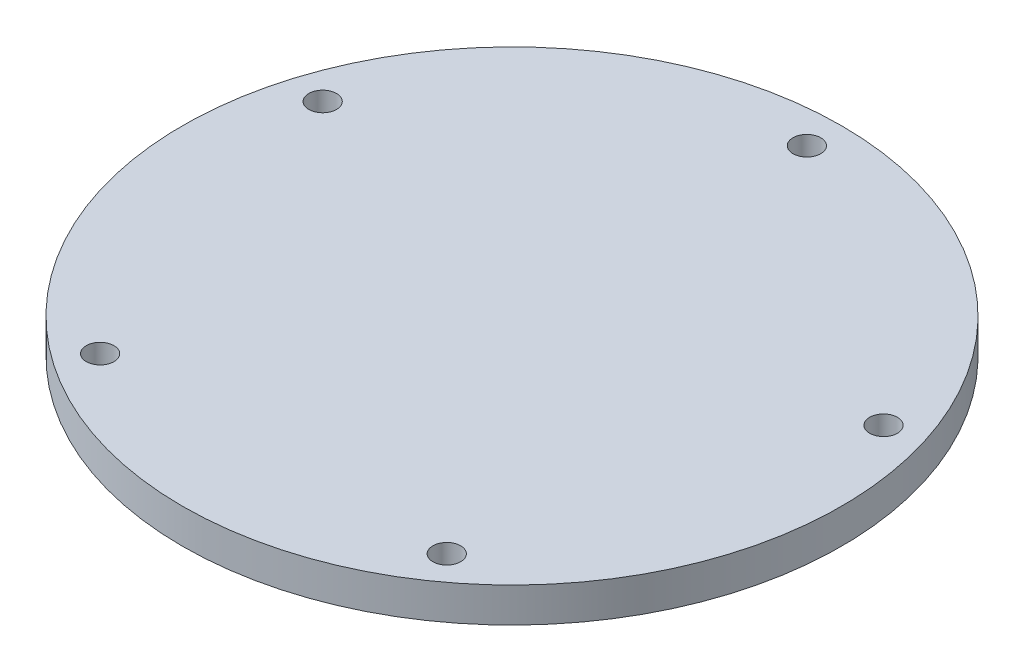
ISO-10303-21;
HEADER;
FILE_DESCRIPTION(('STEP AP214'),'2;1');
FILE_NAME('part.step','',(''),(''),'','','');
FILE_SCHEMA(('AUTOMOTIVE_DESIGN { 1 0 10303 214 1 1 1 1 }'));
ENDSEC;
DATA;
#1=APPLICATION_CONTEXT('core data for automotive mechanical design processes');
#2=APPLICATION_PROTOCOL_DEFINITION('international standard','automotive_design',2000,#1);
#3=PRODUCT_CONTEXT('',#1,'mechanical');
#4=PRODUCT('Part','Part','',(#3));
#5=PRODUCT_RELATED_PRODUCT_CATEGORY('part','',(#4));
#6=PRODUCT_DEFINITION_FORMATION('','',#4);
#7=PRODUCT_DEFINITION_CONTEXT('part definition',#1,'design');
#8=PRODUCT_DEFINITION('design','',#6,#7);
#9=PRODUCT_DEFINITION_SHAPE('','',#8);
#10=(LENGTH_UNIT() NAMED_UNIT(*) SI_UNIT(.MILLI.,.METRE.));
#11=(NAMED_UNIT(*) PLANE_ANGLE_UNIT() SI_UNIT($,.RADIAN.));
#12=(NAMED_UNIT(*) SI_UNIT($,.STERADIAN.) SOLID_ANGLE_UNIT());
#13=UNCERTAINTY_MEASURE_WITH_UNIT(LENGTH_MEASURE(1.E-05),#10,'distance_accuracy_value','');
#14=(GEOMETRIC_REPRESENTATION_CONTEXT(3) GLOBAL_UNCERTAINTY_ASSIGNED_CONTEXT((#13)) GLOBAL_UNIT_ASSIGNED_CONTEXT((#10,
#11,#12)) REPRESENTATION_CONTEXT('',''));
#15=CARTESIAN_POINT('',(0.,0.,0.));
#16=DIRECTION('',(0.,0.,1.));
#17=DIRECTION('',(1.,0.,0.));
#18=AXIS2_PLACEMENT_3D('',#15,#16,#17);
#19=CARTESIAN_POINT('',(0.,5.,0.));
#20=DIRECTION('',(0.,1.,0.));
#21=DIRECTION('',(0.,0.,1.));
#22=AXIS2_PLACEMENT_3D('',#19,#20,#21);
#23=PLANE('',#22);
#24=CARTESIAN_POINT('',(-24.9808732224279,5.,34.383222260936));
#25=DIRECTION('',(0.,1.,0.));
#26=DIRECTION('',(0.,0.,1.));
#27=AXIS2_PLACEMENT_3D('',#24,#25,#26);
#28=CIRCLE('',#27,2.00000000000265);
#29=CARTESIAN_POINT('',(-24.9808732224279,5.,36.3832222609386));
#30=VERTEX_POINT('',#29);
#31=EDGE_CURVE('E60',#30,#30,#28,.T.);
#32=ORIENTED_EDGE('',*,*,#31,.F.);
#33=EDGE_LOOP('',(#32));
#34=FACE_BOUND('',#33,.T.);
#35=CARTESIAN_POINT('',(40.4199019425449,5.,-13.1332222609364));
#36=DIRECTION('',(0.,1.,0.));
#37=DIRECTION('',(0.,0.,1.));
#38=AXIS2_PLACEMENT_3D('',#35,#36,#37);
#39=CIRCLE('',#38,2.00000000000058);
#40=CARTESIAN_POINT('',(40.4199019425449,5.,-11.1332222609358));
#41=VERTEX_POINT('',#40);
#42=EDGE_CURVE('E48',#41,#41,#39,.T.);
#43=ORIENTED_EDGE('',*,*,#42,.F.);
#44=EDGE_LOOP('',(#43));
#45=FACE_BOUND('',#44,.T.);
#46=CARTESIAN_POINT('',(0.,5.,0.));
#47=DIRECTION('',(0.,1.,0.));
#48=DIRECTION('',(0.,0.,1.));
#49=AXIS2_PLACEMENT_3D('',#46,#47,#48);
#50=CIRCLE('',#49,47.5);
#51=CARTESIAN_POINT('',(0.,5.,47.5));
#52=VERTEX_POINT('',#51);
#53=EDGE_CURVE('E10',#52,#52,#50,.T.);
#54=ORIENTED_EDGE('',*,*,#53,.T.);
#55=EDGE_LOOP('',(#54));
#56=FACE_BOUND('',#55,.T.);
#57=CARTESIAN_POINT('',(0.,5.,-42.5));
#58=DIRECTION('',(0.,1.,0.));
#59=DIRECTION('',(0.,0.,1.));
#60=AXIS2_PLACEMENT_3D('',#57,#58,#59);
#61=CIRCLE('',#60,2.);
#62=CARTESIAN_POINT('',(0.,5.,-40.5));
#63=VERTEX_POINT('',#62);
#64=EDGE_CURVE('E43',#63,#63,#61,.T.);
#65=ORIENTED_EDGE('',*,*,#64,.F.);
#66=EDGE_LOOP('',(#65));
#67=FACE_BOUND('',#66,.T.);
#68=CARTESIAN_POINT('',(24.9808732224323,5.,34.3832222609346));
#69=DIRECTION('',(0.,1.,0.));
#70=DIRECTION('',(0.,0.,1.));
#71=AXIS2_PLACEMENT_3D('',#68,#69,#70);
#72=CIRCLE('',#71,2.00000000000211);
#73=CARTESIAN_POINT('',(24.9808732224323,5.,36.3832222609367));
#74=VERTEX_POINT('',#73);
#75=EDGE_CURVE('E54',#74,#74,#72,.T.);
#76=ORIENTED_EDGE('',*,*,#75,.F.);
#77=EDGE_LOOP('',(#76));
#78=FACE_BOUND('',#77,.T.);
#79=CARTESIAN_POINT('',(-40.4199019425432,5.,-13.1332222609341));
#80=DIRECTION('',(0.,1.,0.));
#81=DIRECTION('',(0.,0.,1.));
#82=AXIS2_PLACEMENT_3D('',#79,#80,#81);
#83=CIRCLE('',#82,2.00000000000161);
#84=CARTESIAN_POINT('',(-40.4199019425432,5.,-11.1332222609325));
#85=VERTEX_POINT('',#84);
#86=EDGE_CURVE('E66',#85,#85,#83,.T.);
#87=ORIENTED_EDGE('',*,*,#86,.F.);
#88=EDGE_LOOP('',(#87));
#89=FACE_BOUND('',#88,.T.);
#90=ADVANCED_FACE('F32',(#34,#45,#56,#67,#78,#89),#23,.T.);
#91=CARTESIAN_POINT('',(0.,0.,0.));
#92=DIRECTION('',(0.,1.,0.));
#93=DIRECTION('',(0.,0.,1.));
#94=AXIS2_PLACEMENT_3D('',#91,#92,#93);
#95=PLANE('',#94);
#96=CARTESIAN_POINT('',(0.,0.,0.));
#97=DIRECTION('',(0.,1.,0.));
#98=DIRECTION('',(0.,0.,1.));
#99=AXIS2_PLACEMENT_3D('',#96,#97,#98);
#100=CIRCLE('',#99,47.5);
#101=CARTESIAN_POINT('',(0.,0.,47.5));
#102=VERTEX_POINT('',#101);
#103=EDGE_CURVE('E36',#102,#102,#100,.T.);
#104=ORIENTED_EDGE('',*,*,#103,.F.);
#105=EDGE_LOOP('',(#104));
#106=FACE_BOUND('',#105,.T.);
#107=CARTESIAN_POINT('',(0.,0.,-42.5));
#108=DIRECTION('',(0.,1.,0.));
#109=DIRECTION('',(0.,0.,1.));
#110=AXIS2_PLACEMENT_3D('',#107,#108,#109);
#111=CIRCLE('',#110,2.);
#112=CARTESIAN_POINT('',(0.,0.,-40.5));
#113=VERTEX_POINT('',#112);
#114=EDGE_CURVE('E45',#113,#113,#111,.T.);
#115=ORIENTED_EDGE('',*,*,#114,.T.);
#116=EDGE_LOOP('',(#115));
#117=FACE_BOUND('',#116,.T.);
#118=CARTESIAN_POINT('',(40.4199019425449,0.,-13.1332222609364));
#119=DIRECTION('',(0.,1.,0.));
#120=DIRECTION('',(0.,0.,1.));
#121=AXIS2_PLACEMENT_3D('',#118,#119,#120);
#122=CIRCLE('',#121,2.00000000000058);
#123=CARTESIAN_POINT('',(40.4199019425449,0.,-11.1332222609358));
#124=VERTEX_POINT('',#123);
#125=EDGE_CURVE('E51',#124,#124,#122,.T.);
#126=ORIENTED_EDGE('',*,*,#125,.T.);
#127=EDGE_LOOP('',(#126));
#128=FACE_BOUND('',#127,.T.);
#129=CARTESIAN_POINT('',(24.9808732224323,0.,34.3832222609346));
#130=DIRECTION('',(0.,1.,0.));
#131=DIRECTION('',(0.,0.,1.));
#132=AXIS2_PLACEMENT_3D('',#129,#130,#131);
#133=CIRCLE('',#132,2.00000000000211);
#134=CARTESIAN_POINT('',(24.9808732224323,0.,36.3832222609367));
#135=VERTEX_POINT('',#134);
#136=EDGE_CURVE('E57',#135,#135,#133,.T.);
#137=ORIENTED_EDGE('',*,*,#136,.T.);
#138=EDGE_LOOP('',(#137));
#139=FACE_BOUND('',#138,.T.);
#140=CARTESIAN_POINT('',(-24.9808732224279,0.,34.383222260936));
#141=DIRECTION('',(0.,1.,0.));
#142=DIRECTION('',(0.,0.,1.));
#143=AXIS2_PLACEMENT_3D('',#140,#141,#142);
#144=CIRCLE('',#143,2.00000000000265);
#145=CARTESIAN_POINT('',(-24.9808732224279,0.,36.3832222609386));
#146=VERTEX_POINT('',#145);
#147=EDGE_CURVE('E63',#146,#146,#144,.T.);
#148=ORIENTED_EDGE('',*,*,#147,.T.);
#149=EDGE_LOOP('',(#148));
#150=FACE_BOUND('',#149,.T.);
#151=CARTESIAN_POINT('',(-40.4199019425432,0.,-13.1332222609341));
#152=DIRECTION('',(0.,1.,0.));
#153=DIRECTION('',(0.,0.,1.));
#154=AXIS2_PLACEMENT_3D('',#151,#152,#153);
#155=CIRCLE('',#154,2.00000000000161);
#156=CARTESIAN_POINT('',(-40.4199019425432,0.,-11.1332222609325));
#157=VERTEX_POINT('',#156);
#158=EDGE_CURVE('E69',#157,#157,#155,.T.);
#159=ORIENTED_EDGE('',*,*,#158,.T.);
#160=EDGE_LOOP('',(#159));
#161=FACE_BOUND('',#160,.T.);
#162=ADVANCED_FACE('F79',(#106,#117,#128,#139,#150,#161),#95,.F.);
#163=CARTESIAN_POINT('',(0.,5.,0.));
#164=DIRECTION('',(0.,-1.,0.));
#165=DIRECTION('',(0.,0.,-1.));
#166=AXIS2_PLACEMENT_3D('',#163,#164,#165);
#167=CYLINDRICAL_SURFACE('',#166,47.5);
#168=ORIENTED_EDGE('',*,*,#53,.F.);
#169=EDGE_LOOP('',(#168));
#170=FACE_BOUND('',#169,.T.);
#171=ORIENTED_EDGE('',*,*,#103,.T.);
#172=EDGE_LOOP('',(#171));
#173=FACE_BOUND('',#172,.T.);
#174=ADVANCED_FACE('F34',(#170,#173),#167,.T.);
#175=CARTESIAN_POINT('',(0.,5.,-42.5));
#176=DIRECTION('',(0.,-1.,0.));
#177=DIRECTION('',(0.,0.,-1.));
#178=AXIS2_PLACEMENT_3D('',#175,#176,#177);
#179=CYLINDRICAL_SURFACE('',#178,2.);
#180=ORIENTED_EDGE('',*,*,#64,.T.);
#181=EDGE_LOOP('',(#180));
#182=FACE_BOUND('',#181,.T.);
#183=ORIENTED_EDGE('',*,*,#114,.F.);
#184=EDGE_LOOP('',(#183));
#185=FACE_BOUND('',#184,.T.);
#186=ADVANCED_FACE('F89',(#182,#185),#179,.F.);
#187=CARTESIAN_POINT('',(40.4199019425449,5.,-13.1332222609364));
#188=DIRECTION('',(0.,-1.,0.));
#189=DIRECTION('',(0.,0.,-1.));
#190=AXIS2_PLACEMENT_3D('',#187,#188,#189);
#191=CYLINDRICAL_SURFACE('',#190,2.00000000000058);
#192=ORIENTED_EDGE('',*,*,#42,.T.);
#193=EDGE_LOOP('',(#192));
#194=FACE_BOUND('',#193,.T.);
#195=ORIENTED_EDGE('',*,*,#125,.F.);
#196=EDGE_LOOP('',(#195));
#197=FACE_BOUND('',#196,.T.);
#198=ADVANCED_FACE('F92',(#194,#197),#191,.F.);
#199=CARTESIAN_POINT('',(24.9808732224323,5.,34.3832222609346));
#200=DIRECTION('',(0.,-1.,0.));
#201=DIRECTION('',(0.,0.,-1.));
#202=AXIS2_PLACEMENT_3D('',#199,#200,#201);
#203=CYLINDRICAL_SURFACE('',#202,2.00000000000211);
#204=ORIENTED_EDGE('',*,*,#75,.T.);
#205=EDGE_LOOP('',(#204));
#206=FACE_BOUND('',#205,.T.);
#207=ORIENTED_EDGE('',*,*,#136,.F.);
#208=EDGE_LOOP('',(#207));
#209=FACE_BOUND('',#208,.T.);
#210=ADVANCED_FACE('F96',(#206,#209),#203,.F.);
#211=CARTESIAN_POINT('',(-24.9808732224279,5.,34.383222260936));
#212=DIRECTION('',(0.,-1.,0.));
#213=DIRECTION('',(0.,0.,-1.));
#214=AXIS2_PLACEMENT_3D('',#211,#212,#213);
#215=CYLINDRICAL_SURFACE('',#214,2.00000000000265);
#216=ORIENTED_EDGE('',*,*,#31,.T.);
#217=EDGE_LOOP('',(#216));
#218=FACE_BOUND('',#217,.T.);
#219=ORIENTED_EDGE('',*,*,#147,.F.);
#220=EDGE_LOOP('',(#219));
#221=FACE_BOUND('',#220,.T.);
#222=ADVANCED_FACE('F100',(#218,#221),#215,.F.);
#223=CARTESIAN_POINT('',(-40.4199019425432,5.,-13.1332222609341));
#224=DIRECTION('',(0.,-1.,0.));
#225=DIRECTION('',(0.,0.,-1.));
#226=AXIS2_PLACEMENT_3D('',#223,#224,#225);
#227=CYLINDRICAL_SURFACE('',#226,2.00000000000161);
#228=ORIENTED_EDGE('',*,*,#86,.T.);
#229=EDGE_LOOP('',(#228));
#230=FACE_BOUND('',#229,.T.);
#231=ORIENTED_EDGE('',*,*,#158,.F.);
#232=EDGE_LOOP('',(#231));
#233=FACE_BOUND('',#232,.T.);
#234=ADVANCED_FACE('F75',(#230,#233),#227,.F.);
#235=CLOSED_SHELL('',(#90,#162,#174,#186,#198,#210,#222,#234));
#236=MANIFOLD_SOLID_BREP('B2',#235);
#237=ADVANCED_BREP_SHAPE_REPRESENTATION('',(#18,#236),#14);
#238=SHAPE_DEFINITION_REPRESENTATION(#9,#237);
ENDSEC;
END-ISO-10303-21;
